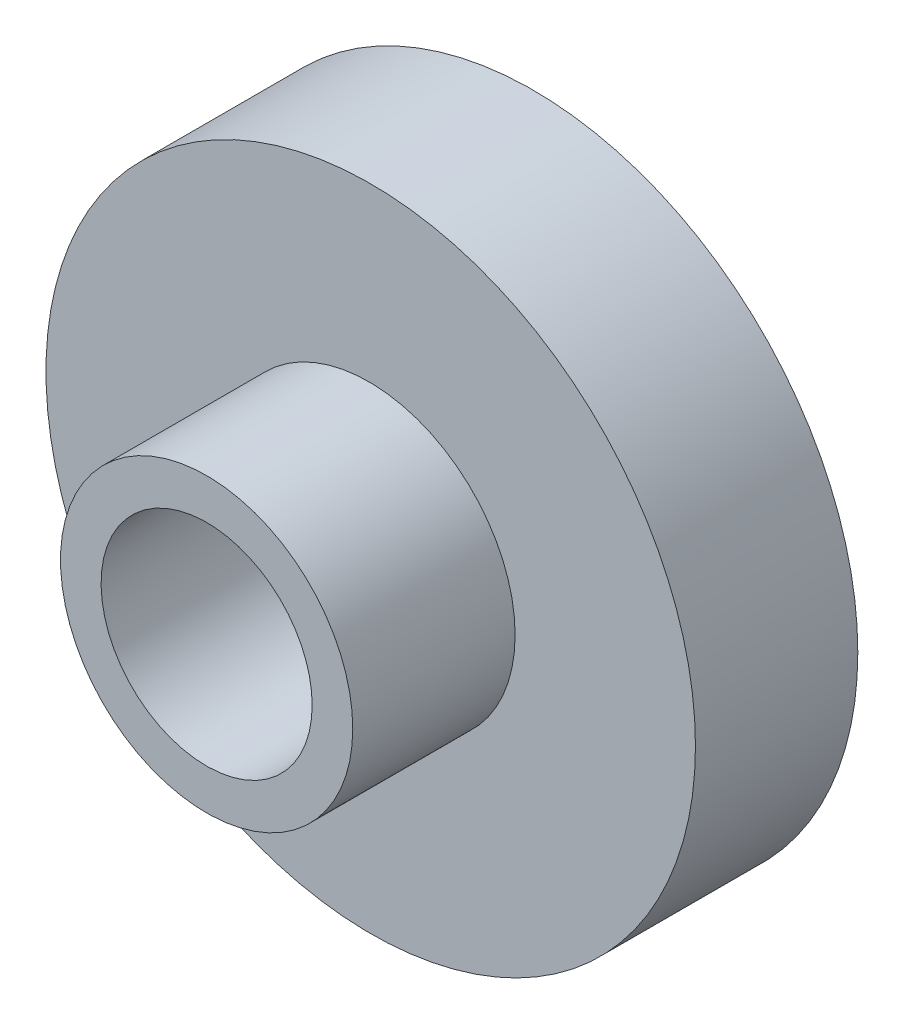
ISO-10303-21;
HEADER;
FILE_DESCRIPTION(('STEP AP214'),'2;1');
FILE_NAME('part.step','',(''),(''),'','','');
FILE_SCHEMA(('AUTOMOTIVE_DESIGN { 1 0 10303 214 1 1 1 1 }'));
ENDSEC;
DATA;
#1=APPLICATION_CONTEXT('core data for automotive mechanical design processes');
#2=APPLICATION_PROTOCOL_DEFINITION('international standard','automotive_design',2000,#1);
#3=PRODUCT_CONTEXT('',#1,'mechanical');
#4=PRODUCT('Part','Part','',(#3));
#5=PRODUCT_RELATED_PRODUCT_CATEGORY('part','',(#4));
#6=PRODUCT_DEFINITION_FORMATION('','',#4);
#7=PRODUCT_DEFINITION_CONTEXT('part definition',#1,'design');
#8=PRODUCT_DEFINITION('design','',#6,#7);
#9=PRODUCT_DEFINITION_SHAPE('','',#8);
#10=(LENGTH_UNIT() NAMED_UNIT(*) SI_UNIT(.MILLI.,.METRE.));
#11=(NAMED_UNIT(*) PLANE_ANGLE_UNIT() SI_UNIT($,.RADIAN.));
#12=(NAMED_UNIT(*) SI_UNIT($,.STERADIAN.) SOLID_ANGLE_UNIT());
#13=UNCERTAINTY_MEASURE_WITH_UNIT(LENGTH_MEASURE(1.E-05),#10,'distance_accuracy_value','');
#14=(GEOMETRIC_REPRESENTATION_CONTEXT(3) GLOBAL_UNCERTAINTY_ASSIGNED_CONTEXT((#13)) GLOBAL_UNIT_ASSIGNED_CONTEXT((#10,
#11,#12)) REPRESENTATION_CONTEXT('',''));
#15=CARTESIAN_POINT('',(0.,0.,0.));
#16=DIRECTION('',(0.,0.,1.));
#17=DIRECTION('',(1.,0.,0.));
#18=AXIS2_PLACEMENT_3D('',#15,#16,#17);
#19=CARTESIAN_POINT('',(0.,0.,5.));
#20=DIRECTION('',(0.,0.,-1.));
#21=DIRECTION('',(-1.,0.,0.));
#22=AXIS2_PLACEMENT_3D('',#19,#20,#21);
#23=CYLINDRICAL_SURFACE('',#22,10.);
#24=CARTESIAN_POINT('',(0.,0.,5.));
#25=DIRECTION('',(0.,0.,1.));
#26=DIRECTION('',(1.,0.,0.));
#27=AXIS2_PLACEMENT_3D('',#24,#25,#26);
#28=CIRCLE('',#27,10.);
#29=CARTESIAN_POINT('',(10.,0.,5.));
#30=VERTEX_POINT('',#29);
#31=EDGE_CURVE('E46',#30,#30,#28,.T.);
#32=ORIENTED_EDGE('',*,*,#31,.F.);
#33=EDGE_LOOP('',(#32));
#34=FACE_BOUND('',#33,.T.);
#35=CARTESIAN_POINT('',(0.,0.,0.));
#36=DIRECTION('',(0.,0.,1.));
#37=DIRECTION('',(1.,0.,0.));
#38=AXIS2_PLACEMENT_3D('',#35,#36,#37);
#39=CIRCLE('',#38,10.);
#40=CARTESIAN_POINT('',(10.,0.,0.));
#41=VERTEX_POINT('',#40);
#42=EDGE_CURVE('E70',#41,#41,#39,.T.);
#43=ORIENTED_EDGE('',*,*,#42,.T.);
#44=EDGE_LOOP('',(#43));
#45=FACE_BOUND('',#44,.T.);
#46=ADVANCED_FACE('F39',(#34,#45),#23,.T.);
#47=CARTESIAN_POINT('',(0.,0.,5.));
#48=DIRECTION('',(0.,0.,1.));
#49=DIRECTION('',(1.,0.,0.));
#50=AXIS2_PLACEMENT_3D('',#47,#48,#49);
#51=PLANE('',#50);
#52=CARTESIAN_POINT('',(-0.0531414130690785,0.193433092701617,5.));
#53=DIRECTION('',(0.,0.,1.));
#54=DIRECTION('',(1.,0.,0.));
#55=AXIS2_PLACEMENT_3D('',#52,#53,#54);
#56=CIRCLE('',#55,4.5);
#57=CARTESIAN_POINT('',(4.44685858693092,0.193433092701617,5.));
#58=VERTEX_POINT('',#57);
#59=EDGE_CURVE('E65',#58,#58,#56,.T.);
#60=ORIENTED_EDGE('',*,*,#59,.F.);
#61=EDGE_LOOP('',(#60));
#62=FACE_BOUND('',#61,.T.);
#63=ORIENTED_EDGE('',*,*,#31,.T.);
#64=EDGE_LOOP('',(#63));
#65=FACE_BOUND('',#64,.T.);
#66=ADVANCED_FACE('F84',(#62,#65),#51,.T.);
#67=CARTESIAN_POINT('',(0.,0.,0.));
#68=DIRECTION('',(0.,0.,1.));
#69=DIRECTION('',(1.,0.,0.));
#70=AXIS2_PLACEMENT_3D('',#67,#68,#69);
#71=PLANE('',#70);
#72=CARTESIAN_POINT('',(0.,0.,0.));
#73=DIRECTION('',(0.,0.,1.));
#74=DIRECTION('',(1.,0.,0.));
#75=AXIS2_PLACEMENT_3D('',#72,#73,#74);
#76=CIRCLE('',#75,3.45060002775446);
#77=CARTESIAN_POINT('',(3.45060002775446,0.,0.));
#78=VERTEX_POINT('',#77);
#79=EDGE_CURVE('E55',#78,#78,#76,.T.);
#80=ORIENTED_EDGE('',*,*,#79,.T.);
#81=EDGE_LOOP('',(#80));
#82=FACE_BOUND('',#81,.T.);
#83=ORIENTED_EDGE('',*,*,#42,.F.);
#84=EDGE_LOOP('',(#83));
#85=FACE_BOUND('',#84,.T.);
#86=ADVANCED_FACE('F81',(#82,#85),#71,.F.);
#87=CARTESIAN_POINT('',(-0.0531414130690785,0.193433092701617,10.));
#88=DIRECTION('',(0.,0.,1.));
#89=DIRECTION('',(1.,0.,0.));
#90=AXIS2_PLACEMENT_3D('',#87,#88,#89);
#91=PLANE('',#90);
#92=CARTESIAN_POINT('',(-0.0531414130690785,0.193433092701617,10.));
#93=DIRECTION('',(0.,0.,1.));
#94=DIRECTION('',(1.,0.,0.));
#95=AXIS2_PLACEMENT_3D('',#92,#93,#94);
#96=CIRCLE('',#95,4.5);
#97=CARTESIAN_POINT('',(4.44685858693092,0.193433092701617,10.));
#98=VERTEX_POINT('',#97);
#99=EDGE_CURVE('E66',#98,#98,#96,.T.);
#100=ORIENTED_EDGE('',*,*,#99,.T.);
#101=EDGE_LOOP('',(#100));
#102=FACE_BOUND('',#101,.T.);
#103=CARTESIAN_POINT('',(-0.0531414130690785,0.193433092701617,10.));
#104=DIRECTION('',(0.,0.,1.));
#105=DIRECTION('',(1.,0.,0.));
#106=AXIS2_PLACEMENT_3D('',#103,#104,#105);
#107=CIRCLE('',#106,3.25);
#108=CARTESIAN_POINT('',(3.19685858693092,0.193433092701617,10.));
#109=VERTEX_POINT('',#108);
#110=EDGE_CURVE('E59',#109,#109,#107,.T.);
#111=ORIENTED_EDGE('',*,*,#110,.F.);
#112=EDGE_LOOP('',(#111));
#113=FACE_BOUND('',#112,.T.);
#114=ADVANCED_FACE('F83',(#102,#113),#91,.T.);
#115=CARTESIAN_POINT('',(-0.0531414130690785,0.193433092701617,10.));
#116=DIRECTION('',(0.,0.,-1.));
#117=DIRECTION('',(-1.,0.,0.));
#118=AXIS2_PLACEMENT_3D('',#115,#116,#117);
#119=CYLINDRICAL_SURFACE('',#118,4.5);
#120=ORIENTED_EDGE('',*,*,#99,.F.);
#121=EDGE_LOOP('',(#120));
#122=FACE_BOUND('',#121,.T.);
#123=ORIENTED_EDGE('',*,*,#59,.T.);
#124=EDGE_LOOP('',(#123));
#125=FACE_BOUND('',#124,.T.);
#126=ADVANCED_FACE('F90',(#122,#125),#119,.T.);
#127=CARTESIAN_POINT('',(-0.0531414130690785,0.193433092701617,10.));
#128=DIRECTION('',(0.,0.,-1.));
#129=DIRECTION('',(-1.,0.,0.));
#130=AXIS2_PLACEMENT_3D('',#127,#128,#129);
#131=CYLINDRICAL_SURFACE('',#130,3.25);
#132=ORIENTED_EDGE('',*,*,#110,.T.);
#133=EDGE_LOOP('',(#132));
#134=FACE_BOUND('',#133,.T.);
#135=CARTESIAN_POINT('',(-0.0531414130690785,0.193433092701617,5.));
#136=DIRECTION('',(0.,0.,1.));
#137=DIRECTION('',(1.,0.,0.));
#138=AXIS2_PLACEMENT_3D('',#135,#136,#137);
#139=CIRCLE('',#138,3.25);
#140=CARTESIAN_POINT('',(-0.914106361119361,3.32731875721281,5.));
#141=VERTEX_POINT('',#140);
#142=EDGE_CURVE('E11',#141,#141,#139,.F.);
#143=ORIENTED_EDGE('',*,*,#142,.T.);
#144=EDGE_LOOP('',(#143));
#145=FACE_BOUND('',#144,.T.);
#146=ADVANCED_FACE('F120',(#134,#145),#131,.F.);
#147=CARTESIAN_POINT('',(0.,0.,5.));
#148=DIRECTION('',(0.,0.,1.));
#149=DIRECTION('',(1.,0.,0.));
#150=AXIS2_PLACEMENT_3D('',#147,#148,#149);
#151=PLANE('',#150);
#152=CARTESIAN_POINT('',(0.,0.,5.));
#153=DIRECTION('',(0.,0.,1.));
#154=DIRECTION('',(1.,0.,0.));
#155=AXIS2_PLACEMENT_3D('',#152,#153,#154);
#156=CIRCLE('',#155,3.45060002775446);
#157=EDGE_CURVE('E51',#141,#141,#156,.T.);
#158=ORIENTED_EDGE('',*,*,#157,.F.);
#159=ORIENTED_EDGE('',*,*,#142,.F.);
#160=EDGE_LOOP('',(#158,#159));
#161=FACE_BOUND('',#160,.T.);
#162=ADVANCED_FACE('F52',(#161),#151,.F.);
#163=CARTESIAN_POINT('',(0.,0.,0.));
#164=DIRECTION('',(0.,0.,1.));
#165=DIRECTION('',(1.,0.,0.));
#166=AXIS2_PLACEMENT_3D('',#163,#164,#165);
#167=CYLINDRICAL_SURFACE('',#166,3.45060002775446);
#168=ORIENTED_EDGE('',*,*,#79,.F.);
#169=EDGE_LOOP('',(#168));
#170=FACE_BOUND('',#169,.T.);
#171=ORIENTED_EDGE('',*,*,#157,.T.);
#172=EDGE_LOOP('',(#171));
#173=FACE_BOUND('',#172,.T.);
#174=ADVANCED_FACE('F143',(#170,#173),#167,.F.);
#175=CLOSED_SHELL('',(#46,#66,#86,#114,#126,#146,#162,#174));
#176=MANIFOLD_SOLID_BREP('B2',#175);
#177=ADVANCED_BREP_SHAPE_REPRESENTATION('',(#18,#176),#14);
#178=SHAPE_DEFINITION_REPRESENTATION(#9,#177);
ENDSEC;
END-ISO-10303-21;
